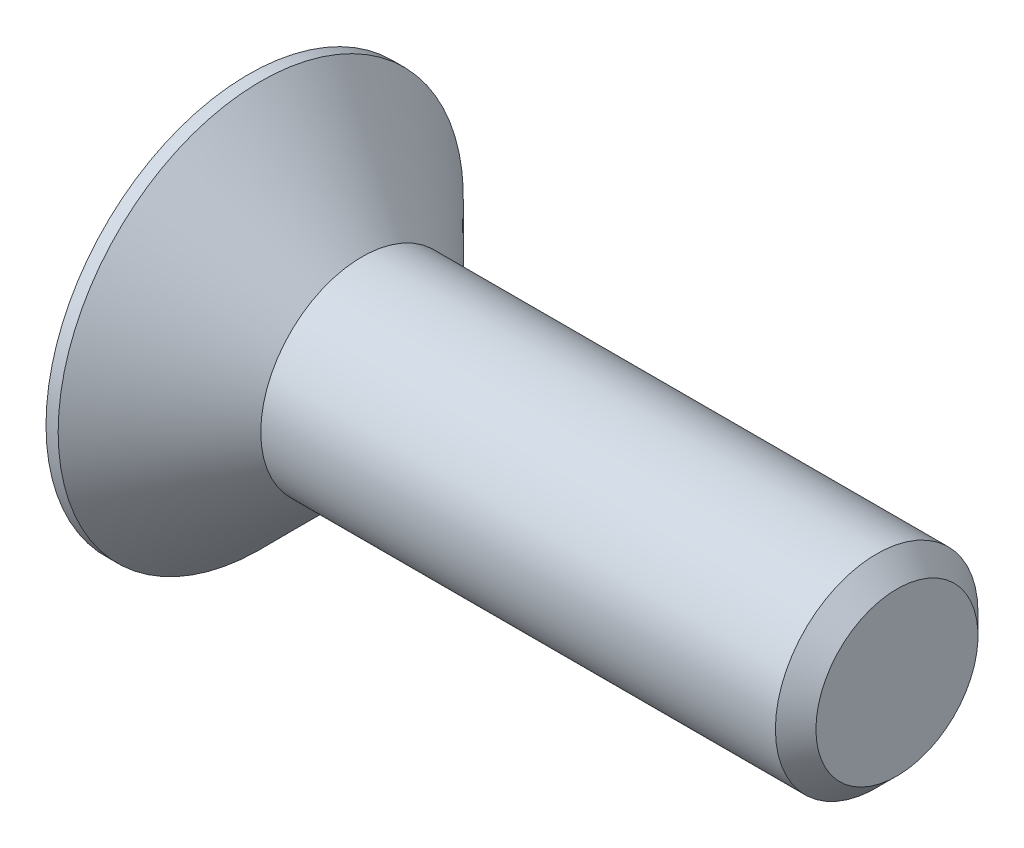
ISO-10303-21;
HEADER;
FILE_DESCRIPTION(('STEP AP214'),'2;1');
FILE_NAME('part.step','',(''),(''),'','','');
FILE_SCHEMA(('AUTOMOTIVE_DESIGN { 1 0 10303 214 1 1 1 1 }'));
ENDSEC;
DATA;
#1=APPLICATION_CONTEXT('core data for automotive mechanical design processes');
#2=APPLICATION_PROTOCOL_DEFINITION('international standard','automotive_design',2000,#1);
#3=PRODUCT_CONTEXT('',#1,'mechanical');
#4=PRODUCT('Part','Part','',(#3));
#5=PRODUCT_RELATED_PRODUCT_CATEGORY('part','',(#4));
#6=PRODUCT_DEFINITION_FORMATION('','',#4);
#7=PRODUCT_DEFINITION_CONTEXT('part definition',#1,'design');
#8=PRODUCT_DEFINITION('design','',#6,#7);
#9=PRODUCT_DEFINITION_SHAPE('','',#8);
#10=(LENGTH_UNIT() NAMED_UNIT(*) SI_UNIT(.MILLI.,.METRE.));
#11=(NAMED_UNIT(*) PLANE_ANGLE_UNIT() SI_UNIT($,.RADIAN.));
#12=(NAMED_UNIT(*) SI_UNIT($,.STERADIAN.) SOLID_ANGLE_UNIT());
#13=UNCERTAINTY_MEASURE_WITH_UNIT(LENGTH_MEASURE(1.E-05),#10,'distance_accuracy_value','');
#14=(GEOMETRIC_REPRESENTATION_CONTEXT(3) GLOBAL_UNCERTAINTY_ASSIGNED_CONTEXT((#13)) GLOBAL_UNIT_ASSIGNED_CONTEXT((#10,
#11,#12)) REPRESENTATION_CONTEXT('',''));
#15=CARTESIAN_POINT('',(0.,0.,0.));
#16=DIRECTION('',(0.,0.,1.));
#17=DIRECTION('',(1.,0.,0.));
#18=AXIS2_PLACEMENT_3D('',#15,#16,#17);
#19=CARTESIAN_POINT('',(0.,0.,0.));
#20=DIRECTION('',(1.,0.,0.));
#21=DIRECTION('',(0.,0.,-1.));
#22=AXIS2_PLACEMENT_3D('',#19,#20,#21);
#23=PLANE('',#22);
#24=DIRECTION('',(0.,0.866025403784439,0.5));
#25=VECTOR('',#24,1.);
#26=CARTESIAN_POINT('',(0.,-0.75,0.433012701892219));
#27=LINE('',#26,#25);
#28=CARTESIAN_POINT('',(0.,-0.75,0.433012701892219));
#29=VERTEX_POINT('',#28);
#30=CARTESIAN_POINT('',(0.,0.,0.866025403784438));
#31=VERTEX_POINT('',#30);
#32=EDGE_CURVE('E122',#29,#31,#27,.T.);
#33=ORIENTED_EDGE('',*,*,#32,.F.);
#34=DIRECTION('',(0.,0.,1.));
#35=VECTOR('',#34,1.);
#36=CARTESIAN_POINT('',(0.,-0.75,-0.43301270189222));
#37=LINE('',#36,#35);
#38=CARTESIAN_POINT('',(0.,-0.75,-0.43301270189222));
#39=VERTEX_POINT('',#38);
#40=EDGE_CURVE('E48',#39,#29,#37,.T.);
#41=ORIENTED_EDGE('',*,*,#40,.F.);
#42=DIRECTION('',(0.,-0.866025403784439,0.5));
#43=VECTOR('',#42,1.);
#44=CARTESIAN_POINT('',(0.,0.,-0.866025403784439));
#45=LINE('',#44,#43);
#46=CARTESIAN_POINT('',(0.,0.,-0.866025403784439));
#47=VERTEX_POINT('',#46);
#48=EDGE_CURVE('E131',#47,#39,#45,.T.);
#49=ORIENTED_EDGE('',*,*,#48,.F.);
#50=DIRECTION('',(0.,-0.866025403784439,-0.5));
#51=VECTOR('',#50,1.);
#52=CARTESIAN_POINT('',(0.,0.75,-0.43301270189222));
#53=LINE('',#52,#51);
#54=CARTESIAN_POINT('',(0.,0.75,-0.43301270189222));
#55=VERTEX_POINT('',#54);
#56=EDGE_CURVE('E129',#55,#47,#53,.T.);
#57=ORIENTED_EDGE('',*,*,#56,.F.);
#58=DIRECTION('',(0.,0.,-1.));
#59=VECTOR('',#58,1.);
#60=CARTESIAN_POINT('',(0.,0.75,0.433012701892219));
#61=LINE('',#60,#59);
#62=CARTESIAN_POINT('',(0.,0.75,0.433012701892219));
#63=VERTEX_POINT('',#62);
#64=EDGE_CURVE('E96',#63,#55,#61,.T.);
#65=ORIENTED_EDGE('',*,*,#64,.F.);
#66=DIRECTION('',(0.,0.866025403784439,-0.5));
#67=VECTOR('',#66,1.);
#68=CARTESIAN_POINT('',(0.,0.,0.866025403784438));
#69=LINE('',#68,#67);
#70=EDGE_CURVE('E125',#31,#63,#69,.T.);
#71=ORIENTED_EDGE('',*,*,#70,.F.);
#72=EDGE_LOOP('',(#33,#41,#49,#57,#65,#71));
#73=FACE_BOUND('',#72,.T.);
#74=CARTESIAN_POINT('',(0.,0.,0.));
#75=DIRECTION('',(-1.,0.,0.));
#76=DIRECTION('',(0.,0.,1.));
#77=AXIS2_PLACEMENT_3D('',#74,#75,#76);
#78=CIRCLE('',#77,2.5);
#79=CARTESIAN_POINT('',(0.,0.,2.5));
#80=VERTEX_POINT('',#79);
#81=EDGE_CURVE('E11',#80,#80,#78,.T.);
#82=ORIENTED_EDGE('',*,*,#81,.T.);
#83=EDGE_LOOP('',(#82));
#84=FACE_BOUND('',#83,.T.);
#85=ADVANCED_FACE('F34',(#73,#84),#23,.F.);
#86=CARTESIAN_POINT('',(-2.28184155946539,0.,0.));
#87=DIRECTION('',(-1.,0.,0.));
#88=DIRECTION('',(0.,0.,1.));
#89=AXIS2_PLACEMENT_3D('',#86,#87,#88);
#90=CYLINDRICAL_SURFACE('',#89,2.5);
#91=ORIENTED_EDGE('',*,*,#81,.F.);
#92=EDGE_LOOP('',(#91));
#93=FACE_BOUND('',#92,.T.);
#94=CARTESIAN_POINT('',(0.15,0.,0.));
#95=DIRECTION('',(-1.,0.,0.));
#96=DIRECTION('',(0.,0.,1.));
#97=AXIS2_PLACEMENT_3D('',#94,#95,#96);
#98=CIRCLE('',#97,2.5);
#99=CARTESIAN_POINT('',(0.15,0.,2.5));
#100=VERTEX_POINT('',#99);
#101=EDGE_CURVE('E41',#100,#100,#98,.T.);
#102=ORIENTED_EDGE('',*,*,#101,.T.);
#103=EDGE_LOOP('',(#102));
#104=FACE_BOUND('',#103,.T.);
#105=ADVANCED_FACE('F151',(#93,#104),#90,.T.);
#106=CARTESIAN_POINT('',(1.4,0.,0.));
#107=DIRECTION('',(-1.,0.,0.));
#108=DIRECTION('',(0.,0.,1.));
#109=AXIS2_PLACEMENT_3D('',#106,#107,#108);
#110=CONICAL_SURFACE('',#109,1.25,0.78539816339745);
#111=ORIENTED_EDGE('',*,*,#101,.F.);
#112=EDGE_LOOP('',(#111));
#113=FACE_BOUND('',#112,.T.);
#114=CARTESIAN_POINT('',(1.4,0.,0.));
#115=DIRECTION('',(-1.,0.,0.));
#116=DIRECTION('',(0.,0.,1.));
#117=AXIS2_PLACEMENT_3D('',#114,#115,#116);
#118=CIRCLE('',#117,1.25);
#119=CARTESIAN_POINT('',(1.4,0.,1.25));
#120=VERTEX_POINT('',#119);
#121=EDGE_CURVE('E146',#120,#120,#118,.T.);
#122=ORIENTED_EDGE('',*,*,#121,.T.);
#123=EDGE_LOOP('',(#122));
#124=FACE_BOUND('',#123,.T.);
#125=ADVANCED_FACE('F153',(#113,#124),#110,.T.);
#126=CARTESIAN_POINT('',(-2.28184155946539,0.,0.));
#127=DIRECTION('',(-1.,0.,0.));
#128=DIRECTION('',(0.,0.,1.));
#129=AXIS2_PLACEMENT_3D('',#126,#127,#128);
#130=CYLINDRICAL_SURFACE('',#129,1.25);
#131=ORIENTED_EDGE('',*,*,#121,.F.);
#132=EDGE_LOOP('',(#131));
#133=FACE_BOUND('',#132,.T.);
#134=CARTESIAN_POINT('',(7.75,0.,0.));
#135=DIRECTION('',(-1.,0.,0.));
#136=DIRECTION('',(0.,0.,1.));
#137=AXIS2_PLACEMENT_3D('',#134,#135,#136);
#138=CIRCLE('',#137,1.25);
#139=CARTESIAN_POINT('',(7.75,0.,1.25));
#140=VERTEX_POINT('',#139);
#141=EDGE_CURVE('E143',#140,#140,#138,.T.);
#142=ORIENTED_EDGE('',*,*,#141,.T.);
#143=EDGE_LOOP('',(#142));
#144=FACE_BOUND('',#143,.T.);
#145=ADVANCED_FACE('F156',(#133,#144),#130,.T.);
#146=CARTESIAN_POINT('',(8.,0.,0.));
#147=DIRECTION('',(-1.,0.,0.));
#148=DIRECTION('',(0.,0.,1.));
#149=AXIS2_PLACEMENT_3D('',#146,#147,#148);
#150=CONICAL_SURFACE('',#149,1.,0.785398163397448);
#151=ORIENTED_EDGE('',*,*,#141,.F.);
#152=EDGE_LOOP('',(#151));
#153=FACE_BOUND('',#152,.T.);
#154=CARTESIAN_POINT('',(8.,0.,0.));
#155=DIRECTION('',(-1.,0.,0.));
#156=DIRECTION('',(0.,0.,1.));
#157=AXIS2_PLACEMENT_3D('',#154,#155,#156);
#158=CIRCLE('',#157,1.);
#159=CARTESIAN_POINT('',(8.,0.,1.));
#160=VERTEX_POINT('',#159);
#161=EDGE_CURVE('E135',#160,#160,#158,.T.);
#162=ORIENTED_EDGE('',*,*,#161,.T.);
#163=EDGE_LOOP('',(#162));
#164=FACE_BOUND('',#163,.T.);
#165=ADVANCED_FACE('F162',(#153,#164),#150,.T.);
#166=CARTESIAN_POINT('',(8.,1.,0.));
#167=DIRECTION('',(-1.,0.,0.));
#168=DIRECTION('',(0.,0.,1.));
#169=AXIS2_PLACEMENT_3D('',#166,#167,#168);
#170=PLANE('',#169);
#171=ORIENTED_EDGE('',*,*,#161,.F.);
#172=EDGE_LOOP('',(#171));
#173=FACE_BOUND('',#172,.T.);
#174=ADVANCED_FACE('F168',(#173),#170,.F.);
#175=CARTESIAN_POINT('',(0.8,-0.75,-0.43301270189222));
#176=DIRECTION('',(0.,-1.,0.));
#177=DIRECTION('',(0.,0.,-1.));
#178=AXIS2_PLACEMENT_3D('',#175,#176,#177);
#179=PLANE('',#178);
#180=ORIENTED_EDGE('',*,*,#40,.T.);
#181=DIRECTION('',(-1.,0.,0.));
#182=VECTOR('',#181,1.);
#183=CARTESIAN_POINT('',(0.8,-0.75,0.433012701892219));
#184=LINE('',#183,#182);
#185=CARTESIAN_POINT('',(0.8,-0.75,0.433012701892219));
#186=VERTEX_POINT('',#185);
#187=EDGE_CURVE('E78',#186,#29,#184,.T.);
#188=ORIENTED_EDGE('',*,*,#187,.F.);
#189=DIRECTION('',(0.,0.,1.));
#190=VECTOR('',#189,1.);
#191=CARTESIAN_POINT('',(0.8,-0.75,-0.43301270189222));
#192=LINE('',#191,#190);
#193=CARTESIAN_POINT('',(0.8,-0.75,-0.43301270189222));
#194=VERTEX_POINT('',#193);
#195=EDGE_CURVE('E133',#194,#186,#192,.T.);
#196=ORIENTED_EDGE('',*,*,#195,.F.);
#197=DIRECTION('',(-1.,0.,0.));
#198=VECTOR('',#197,1.);
#199=CARTESIAN_POINT('',(0.8,-0.75,-0.43301270189222));
#200=LINE('',#199,#198);
#201=EDGE_CURVE('E56',#194,#39,#200,.T.);
#202=ORIENTED_EDGE('',*,*,#201,.T.);
#203=EDGE_LOOP('',(#180,#188,#196,#202));
#204=FACE_BOUND('',#203,.T.);
#205=ADVANCED_FACE('F173',(#204),#179,.F.);
#206=CARTESIAN_POINT('',(0.8,0.,-0.866025403784439));
#207=DIRECTION('',(0.,-0.5,-0.866025403784439));
#208=DIRECTION('',(0.,0.866025403784439,-0.5));
#209=AXIS2_PLACEMENT_3D('',#206,#207,#208);
#210=PLANE('',#209);
#211=ORIENTED_EDGE('',*,*,#48,.T.);
#212=ORIENTED_EDGE('',*,*,#201,.F.);
#213=DIRECTION('',(0.,-0.866025403784439,0.5));
#214=VECTOR('',#213,1.);
#215=CARTESIAN_POINT('',(0.8,0.,-0.866025403784439));
#216=LINE('',#215,#214);
#217=CARTESIAN_POINT('',(0.8,0.,-0.866025403784439));
#218=VERTEX_POINT('',#217);
#219=EDGE_CURVE('E108',#218,#194,#216,.T.);
#220=ORIENTED_EDGE('',*,*,#219,.F.);
#221=DIRECTION('',(-1.,0.,0.));
#222=VECTOR('',#221,1.);
#223=CARTESIAN_POINT('',(0.8,0.,-0.866025403784439));
#224=LINE('',#223,#222);
#225=EDGE_CURVE('E100',#218,#47,#224,.T.);
#226=ORIENTED_EDGE('',*,*,#225,.T.);
#227=EDGE_LOOP('',(#211,#212,#220,#226));
#228=FACE_BOUND('',#227,.T.);
#229=ADVANCED_FACE('F178',(#228),#210,.F.);
#230=CARTESIAN_POINT('',(0.8,0.75,-0.43301270189222));
#231=DIRECTION('',(0.,0.5,-0.866025403784439));
#232=DIRECTION('',(0.,0.866025403784439,0.5));
#233=AXIS2_PLACEMENT_3D('',#230,#231,#232);
#234=PLANE('',#233);
#235=ORIENTED_EDGE('',*,*,#56,.T.);
#236=ORIENTED_EDGE('',*,*,#225,.F.);
#237=DIRECTION('',(0.,-0.866025403784439,-0.5));
#238=VECTOR('',#237,1.);
#239=CARTESIAN_POINT('',(0.8,0.75,-0.43301270189222));
#240=LINE('',#239,#238);
#241=CARTESIAN_POINT('',(0.8,0.75,-0.43301270189222));
#242=VERTEX_POINT('',#241);
#243=EDGE_CURVE('E104',#242,#218,#240,.T.);
#244=ORIENTED_EDGE('',*,*,#243,.F.);
#245=DIRECTION('',(-1.,0.,0.));
#246=VECTOR('',#245,1.);
#247=CARTESIAN_POINT('',(0.8,0.75,-0.43301270189222));
#248=LINE('',#247,#246);
#249=EDGE_CURVE('E89',#242,#55,#248,.T.);
#250=ORIENTED_EDGE('',*,*,#249,.T.);
#251=EDGE_LOOP('',(#235,#236,#244,#250));
#252=FACE_BOUND('',#251,.T.);
#253=ADVANCED_FACE('F105',(#252),#234,.F.);
#254=CARTESIAN_POINT('',(0.8,0.75,0.433012701892219));
#255=DIRECTION('',(0.,1.,0.));
#256=DIRECTION('',(0.,0.,1.));
#257=AXIS2_PLACEMENT_3D('',#254,#255,#256);
#258=PLANE('',#257);
#259=ORIENTED_EDGE('',*,*,#64,.T.);
#260=ORIENTED_EDGE('',*,*,#249,.F.);
#261=DIRECTION('',(0.,0.,-1.));
#262=VECTOR('',#261,1.);
#263=CARTESIAN_POINT('',(0.8,0.75,0.433012701892219));
#264=LINE('',#263,#262);
#265=CARTESIAN_POINT('',(0.8,0.75,0.433012701892219));
#266=VERTEX_POINT('',#265);
#267=EDGE_CURVE('E93',#266,#242,#264,.T.);
#268=ORIENTED_EDGE('',*,*,#267,.F.);
#269=DIRECTION('',(-1.,0.,0.));
#270=VECTOR('',#269,1.);
#271=CARTESIAN_POINT('',(0.8,0.75,0.433012701892219));
#272=LINE('',#271,#270);
#273=EDGE_CURVE('E101',#266,#63,#272,.T.);
#274=ORIENTED_EDGE('',*,*,#273,.T.);
#275=EDGE_LOOP('',(#259,#260,#268,#274));
#276=FACE_BOUND('',#275,.T.);
#277=ADVANCED_FACE('F91',(#276),#258,.F.);
#278=CARTESIAN_POINT('',(0.8,0.,0.866025403784438));
#279=DIRECTION('',(0.,0.5,0.866025403784439));
#280=DIRECTION('',(0.,-0.866025403784439,0.5));
#281=AXIS2_PLACEMENT_3D('',#278,#279,#280);
#282=PLANE('',#281);
#283=ORIENTED_EDGE('',*,*,#70,.T.);
#284=ORIENTED_EDGE('',*,*,#273,.F.);
#285=DIRECTION('',(0.,0.866025403784439,-0.5));
#286=VECTOR('',#285,1.);
#287=CARTESIAN_POINT('',(0.8,0.,0.866025403784438));
#288=LINE('',#287,#286);
#289=CARTESIAN_POINT('',(0.8,0.,0.866025403784438));
#290=VERTEX_POINT('',#289);
#291=EDGE_CURVE('E114',#290,#266,#288,.T.);
#292=ORIENTED_EDGE('',*,*,#291,.F.);
#293=DIRECTION('',(-1.,0.,0.));
#294=VECTOR('',#293,1.);
#295=CARTESIAN_POINT('',(0.8,0.,0.866025403784438));
#296=LINE('',#295,#294);
#297=EDGE_CURVE('E138',#290,#31,#296,.T.);
#298=ORIENTED_EDGE('',*,*,#297,.T.);
#299=EDGE_LOOP('',(#283,#284,#292,#298));
#300=FACE_BOUND('',#299,.T.);
#301=ADVANCED_FACE('F204',(#300),#282,.F.);
#302=CARTESIAN_POINT('',(0.8,-0.75,0.433012701892219));
#303=DIRECTION('',(0.,-0.5,0.866025403784439));
#304=DIRECTION('',(0.,-0.866025403784439,-0.5));
#305=AXIS2_PLACEMENT_3D('',#302,#303,#304);
#306=PLANE('',#305);
#307=ORIENTED_EDGE('',*,*,#32,.T.);
#308=ORIENTED_EDGE('',*,*,#297,.F.);
#309=DIRECTION('',(0.,0.866025403784439,0.5));
#310=VECTOR('',#309,1.);
#311=CARTESIAN_POINT('',(0.8,-0.75,0.433012701892219));
#312=LINE('',#311,#310);
#313=EDGE_CURVE('E116',#186,#290,#312,.T.);
#314=ORIENTED_EDGE('',*,*,#313,.F.);
#315=ORIENTED_EDGE('',*,*,#187,.T.);
#316=EDGE_LOOP('',(#307,#308,#314,#315));
#317=FACE_BOUND('',#316,.T.);
#318=ADVANCED_FACE('F192',(#317),#306,.F.);
#319=CARTESIAN_POINT('',(0.8,0.,0.));
#320=DIRECTION('',(-1.,0.,0.));
#321=DIRECTION('',(0.,0.,1.));
#322=AXIS2_PLACEMENT_3D('',#319,#320,#321);
#323=PLANE('',#322);
#324=ORIENTED_EDGE('',*,*,#195,.T.);
#325=ORIENTED_EDGE('',*,*,#313,.T.);
#326=ORIENTED_EDGE('',*,*,#291,.T.);
#327=ORIENTED_EDGE('',*,*,#267,.T.);
#328=ORIENTED_EDGE('',*,*,#243,.T.);
#329=ORIENTED_EDGE('',*,*,#219,.T.);
#330=EDGE_LOOP('',(#324,#325,#326,#327,#328,#329));
#331=FACE_BOUND('',#330,.T.);
#332=ADVANCED_FACE('F111',(#331),#323,.T.);
#333=CLOSED_SHELL('',(#85,#105,#125,#145,#165,#174,#205,#229,#253,#277,#301,#318,#332));
#334=MANIFOLD_SOLID_BREP('B2',#333);
#335=ADVANCED_BREP_SHAPE_REPRESENTATION('',(#18,#334),#14);
#336=SHAPE_DEFINITION_REPRESENTATION(#9,#335);
ENDSEC;
END-ISO-10303-21;
